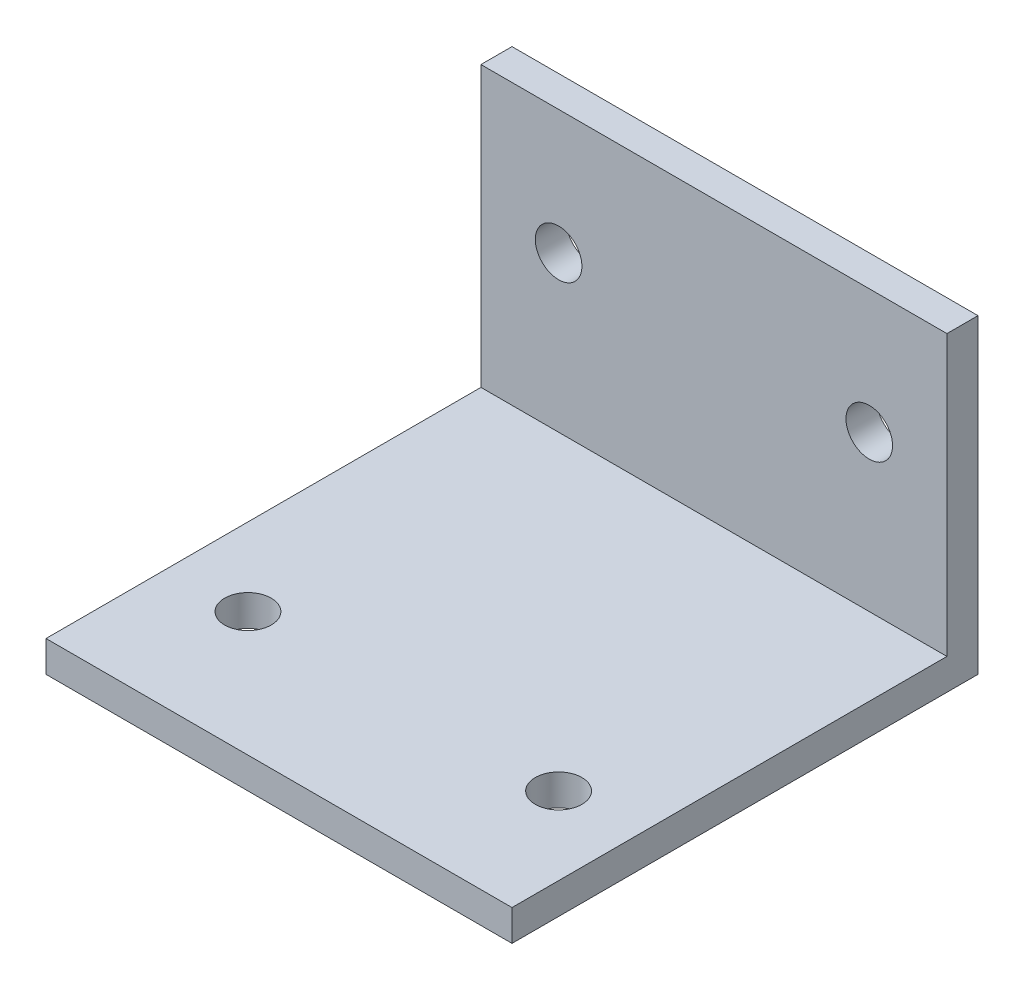
ISO-10303-21;
HEADER;
FILE_DESCRIPTION(('STEP AP214'),'2;1');
FILE_NAME('part.step','',(''),(''),'','','');
FILE_SCHEMA(('AUTOMOTIVE_DESIGN { 1 0 10303 214 1 1 1 1 }'));
ENDSEC;
DATA;
#1=APPLICATION_CONTEXT('core data for automotive mechanical design processes');
#2=APPLICATION_PROTOCOL_DEFINITION('international standard','automotive_design',2000,#1);
#3=PRODUCT_CONTEXT('',#1,'mechanical');
#4=PRODUCT('Part','Part','',(#3));
#5=PRODUCT_RELATED_PRODUCT_CATEGORY('part','',(#4));
#6=PRODUCT_DEFINITION_FORMATION('','',#4);
#7=PRODUCT_DEFINITION_CONTEXT('part definition',#1,'design');
#8=PRODUCT_DEFINITION('design','',#6,#7);
#9=PRODUCT_DEFINITION_SHAPE('','',#8);
#10=(LENGTH_UNIT() NAMED_UNIT(*) SI_UNIT(.MILLI.,.METRE.));
#11=(NAMED_UNIT(*) PLANE_ANGLE_UNIT() SI_UNIT($,.RADIAN.));
#12=(NAMED_UNIT(*) SI_UNIT($,.STERADIAN.) SOLID_ANGLE_UNIT());
#13=UNCERTAINTY_MEASURE_WITH_UNIT(LENGTH_MEASURE(1.E-05),#10,'distance_accuracy_value','');
#14=(GEOMETRIC_REPRESENTATION_CONTEXT(3) GLOBAL_UNCERTAINTY_ASSIGNED_CONTEXT((#13)) GLOBAL_UNIT_ASSIGNED_CONTEXT((#10,
#11,#12)) REPRESENTATION_CONTEXT('',''));
#15=CARTESIAN_POINT('',(0.,0.,0.));
#16=DIRECTION('',(0.,0.,1.));
#17=DIRECTION('',(1.,0.,0.));
#18=AXIS2_PLACEMENT_3D('',#15,#16,#17);
#19=CARTESIAN_POINT('',(15.,19.,3.));
#20=DIRECTION('',(-1.,0.,0.));
#21=DIRECTION('',(0.,0.,1.));
#22=AXIS2_PLACEMENT_3D('',#19,#20,#21);
#23=PLANE('',#22);
#24=DIRECTION('',(0.,0.,-1.));
#25=VECTOR('',#24,1.);
#26=CARTESIAN_POINT('',(15.,2.,3.));
#27=LINE('',#26,#25);
#28=CARTESIAN_POINT('',(15.,2.,3.));
#29=VERTEX_POINT('',#28);
#30=CARTESIAN_POINT('',(15.,2.,1.));
#31=VERTEX_POINT('',#30);
#32=EDGE_CURVE('E48',#29,#31,#27,.T.);
#33=ORIENTED_EDGE('',*,*,#32,.F.);
#34=DIRECTION('',(0.,1.,0.));
#35=VECTOR('',#34,1.);
#36=CARTESIAN_POINT('',(15.,19.,3.));
#37=LINE('',#36,#35);
#38=CARTESIAN_POINT('',(15.,-16.,3.));
#39=VERTEX_POINT('',#38);
#40=EDGE_CURVE('E145',#39,#29,#37,.T.);
#41=ORIENTED_EDGE('',*,*,#40,.F.);
#42=DIRECTION('',(0.,0.,-1.));
#43=VECTOR('',#42,1.);
#44=CARTESIAN_POINT('',(15.,-16.,38.));
#45=LINE('',#44,#43);
#46=CARTESIAN_POINT('',(15.,-16.,31.));
#47=VERTEX_POINT('',#46);
#48=EDGE_CURVE('E143',#47,#39,#45,.T.);
#49=ORIENTED_EDGE('',*,*,#48,.F.);
#50=DIRECTION('',(0.,1.,0.));
#51=VECTOR('',#50,1.);
#52=CARTESIAN_POINT('',(15.,19.,31.));
#53=LINE('',#52,#51);
#54=CARTESIAN_POINT('',(15.,-18.,31.));
#55=VERTEX_POINT('',#54);
#56=EDGE_CURVE('E108',#55,#47,#53,.T.);
#57=ORIENTED_EDGE('',*,*,#56,.F.);
#58=DIRECTION('',(0.,0.,1.));
#59=VECTOR('',#58,1.);
#60=CARTESIAN_POINT('',(15.,-18.,3.));
#61=LINE('',#60,#59);
#62=CARTESIAN_POINT('',(15.,-18.,1.));
#63=VERTEX_POINT('',#62);
#64=EDGE_CURVE('E123',#63,#55,#61,.T.);
#65=ORIENTED_EDGE('',*,*,#64,.F.);
#66=DIRECTION('',(0.,1.,0.));
#67=VECTOR('',#66,1.);
#68=CARTESIAN_POINT('',(15.,19.,1.));
#69=LINE('',#68,#67);
#70=EDGE_CURVE('E103',#63,#31,#69,.T.);
#71=ORIENTED_EDGE('',*,*,#70,.T.);
#72=EDGE_LOOP('',(#33,#41,#49,#57,#65,#71));
#73=FACE_BOUND('',#72,.T.);
#74=ADVANCED_FACE('F35',(#73),#23,.F.);
#75=CARTESIAN_POINT('',(-15.,19.,3.));
#76=DIRECTION('',(1.,0.,0.));
#77=DIRECTION('',(0.,0.,-1.));
#78=AXIS2_PLACEMENT_3D('',#75,#76,#77);
#79=PLANE('',#78);
#80=DIRECTION('',(0.,0.,1.));
#81=VECTOR('',#80,1.);
#82=CARTESIAN_POINT('',(-15.,2.,3.));
#83=LINE('',#82,#81);
#84=CARTESIAN_POINT('',(-15.,2.,1.));
#85=VERTEX_POINT('',#84);
#86=CARTESIAN_POINT('',(-15.,2.,3.));
#87=VERTEX_POINT('',#86);
#88=EDGE_CURVE('E85',#85,#87,#83,.T.);
#89=ORIENTED_EDGE('',*,*,#88,.F.);
#90=DIRECTION('',(0.,-1.,0.));
#91=VECTOR('',#90,1.);
#92=CARTESIAN_POINT('',(-15.,19.,1.));
#93=LINE('',#92,#91);
#94=CARTESIAN_POINT('',(-15.,-18.,1.));
#95=VERTEX_POINT('',#94);
#96=EDGE_CURVE('E94',#85,#95,#93,.T.);
#97=ORIENTED_EDGE('',*,*,#96,.T.);
#98=DIRECTION('',(0.,0.,-1.));
#99=VECTOR('',#98,1.);
#100=CARTESIAN_POINT('',(-15.,-18.,3.));
#101=LINE('',#100,#99);
#102=CARTESIAN_POINT('',(-15.,-18.,31.));
#103=VERTEX_POINT('',#102);
#104=EDGE_CURVE('E121',#103,#95,#101,.T.);
#105=ORIENTED_EDGE('',*,*,#104,.F.);
#106=DIRECTION('',(0.,-1.,0.));
#107=VECTOR('',#106,1.);
#108=CARTESIAN_POINT('',(-15.,19.,31.));
#109=LINE('',#108,#107);
#110=CARTESIAN_POINT('',(-15.,-16.,31.));
#111=VERTEX_POINT('',#110);
#112=EDGE_CURVE('E56',#111,#103,#109,.T.);
#113=ORIENTED_EDGE('',*,*,#112,.F.);
#114=DIRECTION('',(0.,0.,-1.));
#115=VECTOR('',#114,1.);
#116=CARTESIAN_POINT('',(-15.,-16.,38.));
#117=LINE('',#116,#115);
#118=CARTESIAN_POINT('',(-15.,-16.,3.));
#119=VERTEX_POINT('',#118);
#120=EDGE_CURVE('E141',#111,#119,#117,.T.);
#121=ORIENTED_EDGE('',*,*,#120,.T.);
#122=DIRECTION('',(0.,-1.,0.));
#123=VECTOR('',#122,1.);
#124=CARTESIAN_POINT('',(-15.,19.,3.));
#125=LINE('',#124,#123);
#126=EDGE_CURVE('E97',#87,#119,#125,.T.);
#127=ORIENTED_EDGE('',*,*,#126,.F.);
#128=EDGE_LOOP('',(#89,#97,#105,#113,#121,#127));
#129=FACE_BOUND('',#128,.T.);
#130=ADVANCED_FACE('F92',(#129),#79,.F.);
#131=CARTESIAN_POINT('',(0.,0.,3.));
#132=DIRECTION('',(0.,0.,1.));
#133=DIRECTION('',(1.,0.,0.));
#134=AXIS2_PLACEMENT_3D('',#131,#132,#133);
#135=PLANE('',#134);
#136=CARTESIAN_POINT('',(9.99999999999999,-6.,3.));
#137=DIRECTION('',(0.,0.,1.));
#138=DIRECTION('',(1.,0.,0.));
#139=AXIS2_PLACEMENT_3D('',#136,#137,#138);
#140=CIRCLE('',#139,1.5);
#141=CARTESIAN_POINT('',(11.5,-6.,3.));
#142=VERTEX_POINT('',#141);
#143=EDGE_CURVE('E132',#142,#142,#140,.T.);
#144=ORIENTED_EDGE('',*,*,#143,.F.);
#145=EDGE_LOOP('',(#144));
#146=FACE_BOUND('',#145,.T.);
#147=CARTESIAN_POINT('',(-10.,-6.,3.));
#148=DIRECTION('',(0.,0.,1.));
#149=DIRECTION('',(1.,0.,0.));
#150=AXIS2_PLACEMENT_3D('',#147,#148,#149);
#151=CIRCLE('',#150,1.5);
#152=CARTESIAN_POINT('',(-8.5,-6.,3.));
#153=VERTEX_POINT('',#152);
#154=EDGE_CURVE('E135',#153,#153,#151,.T.);
#155=ORIENTED_EDGE('',*,*,#154,.F.);
#156=EDGE_LOOP('',(#155));
#157=FACE_BOUND('',#156,.T.);
#158=ORIENTED_EDGE('',*,*,#40,.T.);
#159=DIRECTION('',(-1.,0.,0.));
#160=VECTOR('',#159,1.);
#161=CARTESIAN_POINT('',(0.,2.,3.));
#162=LINE('',#161,#160);
#163=EDGE_CURVE('E156',#29,#87,#162,.T.);
#164=ORIENTED_EDGE('',*,*,#163,.T.);
#165=ORIENTED_EDGE('',*,*,#126,.T.);
#166=DIRECTION('',(-1.,0.,0.));
#167=VECTOR('',#166,1.);
#168=CARTESIAN_POINT('',(-15.,-16.,3.));
#169=LINE('',#168,#167);
#170=EDGE_CURVE('E138',#39,#119,#169,.T.);
#171=ORIENTED_EDGE('',*,*,#170,.F.);
#172=EDGE_LOOP('',(#158,#164,#165,#171));
#173=FACE_BOUND('',#172,.T.);
#174=ADVANCED_FACE('F165',(#146,#157,#173),#135,.T.);
#175=CARTESIAN_POINT('',(0.,0.,1.));
#176=DIRECTION('',(0.,0.,1.));
#177=DIRECTION('',(1.,0.,0.));
#178=AXIS2_PLACEMENT_3D('',#175,#176,#177);
#179=PLANE('',#178);
#180=CARTESIAN_POINT('',(-10.,-6.,1.));
#181=DIRECTION('',(0.,0.,1.));
#182=DIRECTION('',(1.,0.,0.));
#183=AXIS2_PLACEMENT_3D('',#180,#181,#182);
#184=CIRCLE('',#183,1.5);
#185=CARTESIAN_POINT('',(-8.5,-6.,1.));
#186=VERTEX_POINT('',#185);
#187=EDGE_CURVE('E114',#186,#186,#184,.F.);
#188=ORIENTED_EDGE('',*,*,#187,.F.);
#189=EDGE_LOOP('',(#188));
#190=FACE_BOUND('',#189,.T.);
#191=CARTESIAN_POINT('',(9.99999999999999,-6.,1.));
#192=DIRECTION('',(0.,0.,1.));
#193=DIRECTION('',(1.,0.,0.));
#194=AXIS2_PLACEMENT_3D('',#191,#192,#193);
#195=CIRCLE('',#194,1.5);
#196=CARTESIAN_POINT('',(11.5,-6.,1.));
#197=VERTEX_POINT('',#196);
#198=EDGE_CURVE('E106',#197,#197,#195,.F.);
#199=ORIENTED_EDGE('',*,*,#198,.F.);
#200=EDGE_LOOP('',(#199));
#201=FACE_BOUND('',#200,.T.);
#202=DIRECTION('',(-1.,0.,0.));
#203=VECTOR('',#202,1.);
#204=CARTESIAN_POINT('',(0.,2.,1.));
#205=LINE('',#204,#203);
#206=EDGE_CURVE('E11',#31,#85,#205,.T.);
#207=ORIENTED_EDGE('',*,*,#206,.F.);
#208=ORIENTED_EDGE('',*,*,#70,.F.);
#209=DIRECTION('',(-1.,0.,0.));
#210=VECTOR('',#209,1.);
#211=CARTESIAN_POINT('',(0.,-18.,1.));
#212=LINE('',#211,#210);
#213=EDGE_CURVE('E102',#63,#95,#212,.T.);
#214=ORIENTED_EDGE('',*,*,#213,.T.);
#215=ORIENTED_EDGE('',*,*,#96,.F.);
#216=EDGE_LOOP('',(#207,#208,#214,#215));
#217=FACE_BOUND('',#216,.T.);
#218=ADVANCED_FACE('F100',(#190,#201,#217),#179,.F.);
#219=CARTESIAN_POINT('',(-15.,-16.,38.));
#220=DIRECTION('',(0.,-1.,0.));
#221=DIRECTION('',(0.,0.,-1.));
#222=AXIS2_PLACEMENT_3D('',#219,#220,#221);
#223=PLANE('',#222);
#224=CARTESIAN_POINT('',(-10.,-16.,23.));
#225=DIRECTION('',(0.,1.,0.));
#226=DIRECTION('',(0.,0.,1.));
#227=AXIS2_PLACEMENT_3D('',#224,#225,#226);
#228=CIRCLE('',#227,1.5);
#229=CARTESIAN_POINT('',(-10.,-16.,24.5));
#230=VERTEX_POINT('',#229);
#231=EDGE_CURVE('E129',#230,#230,#228,.T.);
#232=ORIENTED_EDGE('',*,*,#231,.F.);
#233=EDGE_LOOP('',(#232));
#234=FACE_BOUND('',#233,.T.);
#235=CARTESIAN_POINT('',(9.99999999999999,-16.,23.));
#236=DIRECTION('',(0.,1.,0.));
#237=DIRECTION('',(0.,0.,1.));
#238=AXIS2_PLACEMENT_3D('',#235,#236,#237);
#239=CIRCLE('',#238,1.5);
#240=CARTESIAN_POINT('',(9.99999999999999,-16.,24.5));
#241=VERTEX_POINT('',#240);
#242=EDGE_CURVE('E126',#241,#241,#239,.T.);
#243=ORIENTED_EDGE('',*,*,#242,.F.);
#244=EDGE_LOOP('',(#243));
#245=FACE_BOUND('',#244,.T.);
#246=DIRECTION('',(-1.,0.,0.));
#247=VECTOR('',#246,1.);
#248=CARTESIAN_POINT('',(-15.,-16.,31.));
#249=LINE('',#248,#247);
#250=EDGE_CURVE('E104',#47,#111,#249,.T.);
#251=ORIENTED_EDGE('',*,*,#250,.F.);
#252=ORIENTED_EDGE('',*,*,#48,.T.);
#253=ORIENTED_EDGE('',*,*,#170,.T.);
#254=ORIENTED_EDGE('',*,*,#120,.F.);
#255=EDGE_LOOP('',(#251,#252,#253,#254));
#256=FACE_BOUND('',#255,.T.);
#257=ADVANCED_FACE('F160',(#234,#245,#256),#223,.F.);
#258=CARTESIAN_POINT('',(0.,-18.,0.));
#259=DIRECTION('',(0.,-1.,0.));
#260=DIRECTION('',(0.,0.,-1.));
#261=AXIS2_PLACEMENT_3D('',#258,#259,#260);
#262=PLANE('',#261);
#263=CARTESIAN_POINT('',(-10.,-18.,23.));
#264=DIRECTION('',(0.,-1.,0.));
#265=DIRECTION('',(0.,0.,-1.));
#266=AXIS2_PLACEMENT_3D('',#263,#264,#265);
#267=CIRCLE('',#266,1.5);
#268=CARTESIAN_POINT('',(-10.,-18.,21.5));
#269=VERTEX_POINT('',#268);
#270=EDGE_CURVE('E118',#269,#269,#267,.F.);
#271=ORIENTED_EDGE('',*,*,#270,.T.);
#272=EDGE_LOOP('',(#271));
#273=FACE_BOUND('',#272,.T.);
#274=CARTESIAN_POINT('',(9.99999999999999,-18.,23.));
#275=DIRECTION('',(0.,-1.,0.));
#276=DIRECTION('',(0.,0.,-1.));
#277=AXIS2_PLACEMENT_3D('',#274,#275,#276);
#278=CIRCLE('',#277,1.5);
#279=CARTESIAN_POINT('',(9.99999999999999,-18.,21.5));
#280=VERTEX_POINT('',#279);
#281=EDGE_CURVE('E117',#280,#280,#278,.F.);
#282=ORIENTED_EDGE('',*,*,#281,.T.);
#283=EDGE_LOOP('',(#282));
#284=FACE_BOUND('',#283,.T.);
#285=ORIENTED_EDGE('',*,*,#64,.T.);
#286=DIRECTION('',(-1.,0.,0.));
#287=VECTOR('',#286,1.);
#288=CARTESIAN_POINT('',(0.,-18.,31.));
#289=LINE('',#288,#287);
#290=EDGE_CURVE('E42',#55,#103,#289,.T.);
#291=ORIENTED_EDGE('',*,*,#290,.T.);
#292=ORIENTED_EDGE('',*,*,#104,.T.);
#293=ORIENTED_EDGE('',*,*,#213,.F.);
#294=EDGE_LOOP('',(#285,#291,#292,#293));
#295=FACE_BOUND('',#294,.T.);
#296=ADVANCED_FACE('F152',(#273,#284,#295),#262,.T.);
#297=CARTESIAN_POINT('',(-10.,-51.,23.));
#298=DIRECTION('',(0.,1.,0.));
#299=DIRECTION('',(0.,0.,1.));
#300=AXIS2_PLACEMENT_3D('',#297,#298,#299);
#301=CYLINDRICAL_SURFACE('',#300,1.5);
#302=ORIENTED_EDGE('',*,*,#231,.T.);
#303=EDGE_LOOP('',(#302));
#304=FACE_BOUND('',#303,.T.);
#305=ORIENTED_EDGE('',*,*,#270,.F.);
#306=EDGE_LOOP('',(#305));
#307=FACE_BOUND('',#306,.T.);
#308=ADVANCED_FACE('F199',(#304,#307),#301,.F.);
#309=CARTESIAN_POINT('',(9.99999999999999,-51.,23.));
#310=DIRECTION('',(0.,1.,0.));
#311=DIRECTION('',(0.,0.,1.));
#312=AXIS2_PLACEMENT_3D('',#309,#310,#311);
#313=CYLINDRICAL_SURFACE('',#312,1.5);
#314=ORIENTED_EDGE('',*,*,#242,.T.);
#315=EDGE_LOOP('',(#314));
#316=FACE_BOUND('',#315,.T.);
#317=ORIENTED_EDGE('',*,*,#281,.F.);
#318=EDGE_LOOP('',(#317));
#319=FACE_BOUND('',#318,.T.);
#320=ADVANCED_FACE('F196',(#316,#319),#313,.F.);
#321=CARTESIAN_POINT('',(-10.,-6.,-32.));
#322=DIRECTION('',(0.,0.,1.));
#323=DIRECTION('',(1.,0.,0.));
#324=AXIS2_PLACEMENT_3D('',#321,#322,#323);
#325=CYLINDRICAL_SURFACE('',#324,1.5);
#326=ORIENTED_EDGE('',*,*,#187,.T.);
#327=EDGE_LOOP('',(#326));
#328=FACE_BOUND('',#327,.T.);
#329=ORIENTED_EDGE('',*,*,#154,.T.);
#330=EDGE_LOOP('',(#329));
#331=FACE_BOUND('',#330,.T.);
#332=ADVANCED_FACE('F178',(#328,#331),#325,.F.);
#333=CARTESIAN_POINT('',(9.99999999999999,-6.,-32.));
#334=DIRECTION('',(0.,0.,1.));
#335=DIRECTION('',(1.,0.,0.));
#336=AXIS2_PLACEMENT_3D('',#333,#334,#335);
#337=CYLINDRICAL_SURFACE('',#336,1.5);
#338=ORIENTED_EDGE('',*,*,#198,.T.);
#339=EDGE_LOOP('',(#338));
#340=FACE_BOUND('',#339,.T.);
#341=ORIENTED_EDGE('',*,*,#143,.T.);
#342=EDGE_LOOP('',(#341));
#343=FACE_BOUND('',#342,.T.);
#344=ADVANCED_FACE('F171',(#340,#343),#337,.F.);
#345=CARTESIAN_POINT('',(0.,0.,31.));
#346=DIRECTION('',(0.,0.,1.));
#347=DIRECTION('',(1.,0.,0.));
#348=AXIS2_PLACEMENT_3D('',#345,#346,#347);
#349=PLANE('',#348);
#350=ORIENTED_EDGE('',*,*,#250,.T.);
#351=ORIENTED_EDGE('',*,*,#112,.T.);
#352=ORIENTED_EDGE('',*,*,#290,.F.);
#353=ORIENTED_EDGE('',*,*,#56,.T.);
#354=EDGE_LOOP('',(#350,#351,#352,#353));
#355=FACE_BOUND('',#354,.T.);
#356=ADVANCED_FACE('F169',(#355),#349,.T.);
#357=CARTESIAN_POINT('',(0.,2.,0.));
#358=DIRECTION('',(0.,1.,0.));
#359=DIRECTION('',(0.,0.,1.));
#360=AXIS2_PLACEMENT_3D('',#357,#358,#359);
#361=PLANE('',#360);
#362=ORIENTED_EDGE('',*,*,#32,.T.);
#363=ORIENTED_EDGE('',*,*,#206,.T.);
#364=ORIENTED_EDGE('',*,*,#88,.T.);
#365=ORIENTED_EDGE('',*,*,#163,.F.);
#366=EDGE_LOOP('',(#362,#363,#364,#365));
#367=FACE_BOUND('',#366,.T.);
#368=ADVANCED_FACE('F84',(#367),#361,.T.);
#369=CLOSED_SHELL('',(#74,#130,#174,#218,#257,#296,#308,#320,#332,#344,#356,#368));
#370=MANIFOLD_SOLID_BREP('B2',#369);
#371=ADVANCED_BREP_SHAPE_REPRESENTATION('',(#18,#370),#14);
#372=SHAPE_DEFINITION_REPRESENTATION(#9,#371);
ENDSEC;
END-ISO-10303-21;
